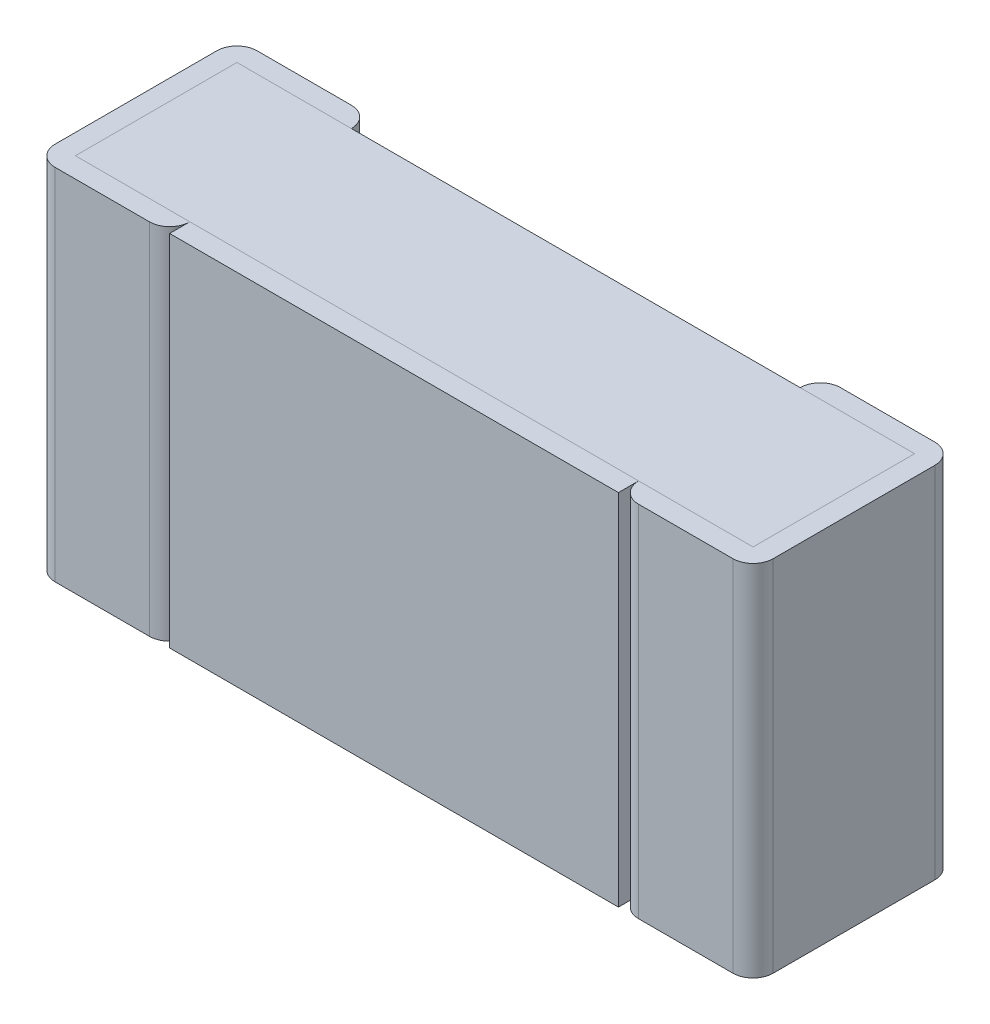
ISO-10303-21;
HEADER;
FILE_DESCRIPTION(('STEP AP214'),'2;1');
FILE_NAME('part.step','',(''),(''),'','','');
FILE_SCHEMA(('AUTOMOTIVE_DESIGN { 1 0 10303 214 1 1 1 1 }'));
ENDSEC;
DATA;
#1=APPLICATION_CONTEXT('core data for automotive mechanical design processes');
#2=APPLICATION_PROTOCOL_DEFINITION('international standard','automotive_design',2000,#1);
#3=PRODUCT_CONTEXT('',#1,'mechanical');
#4=PRODUCT('Part','Part','',(#3));
#5=PRODUCT_RELATED_PRODUCT_CATEGORY('part','',(#4));
#6=PRODUCT_DEFINITION_FORMATION('','',#4);
#7=PRODUCT_DEFINITION_CONTEXT('part definition',#1,'design');
#8=PRODUCT_DEFINITION('design','',#6,#7);
#9=PRODUCT_DEFINITION_SHAPE('','',#8);
#10=(LENGTH_UNIT() NAMED_UNIT(*) SI_UNIT(.MILLI.,.METRE.));
#11=(NAMED_UNIT(*) PLANE_ANGLE_UNIT() SI_UNIT($,.RADIAN.));
#12=(NAMED_UNIT(*) SI_UNIT($,.STERADIAN.) SOLID_ANGLE_UNIT());
#13=UNCERTAINTY_MEASURE_WITH_UNIT(LENGTH_MEASURE(1.E-05),#10,'distance_accuracy_value','');
#14=(GEOMETRIC_REPRESENTATION_CONTEXT(3) GLOBAL_UNCERTAINTY_ASSIGNED_CONTEXT((#13)) GLOBAL_UNIT_ASSIGNED_CONTEXT((#10,
#11,#12)) REPRESENTATION_CONTEXT('',''));
#15=CARTESIAN_POINT('',(0.,0.,0.));
#16=DIRECTION('',(0.,0.,1.));
#17=DIRECTION('',(1.,0.,0.));
#18=AXIS2_PLACEMENT_3D('',#15,#16,#17);
#19=CARTESIAN_POINT('',(132.066744279938,112.30804329235,112.661582908599));
#20=DIRECTION('',(0.,0.,1.));
#21=DIRECTION('',(1.,0.,0.));
#22=AXIS2_PLACEMENT_3D('',#19,#20,#21);
#23=PLANE('',#22);
#24=DIRECTION('',(0.,1.,0.));
#25=VECTOR('',#24,1.);
#26=CARTESIAN_POINT('',(132.066744279938,112.30804329235,112.661582908599));
#27=LINE('',#26,#25);
#28=CARTESIAN_POINT('',(132.066744279938,112.30804329235,112.661582908599));
#29=VERTEX_POINT('',#28);
#30=CARTESIAN_POINT('',(132.066744279938,113.10804329235,112.661582908599));
#31=VERTEX_POINT('',#30);
#32=EDGE_CURVE('E67',#29,#31,#27,.T.);
#33=ORIENTED_EDGE('',*,*,#32,.F.);
#34=DIRECTION('',(1.,0.,0.));
#35=VECTOR('',#34,1.);
#36=CARTESIAN_POINT('',(132.066744279938,112.30804329235,112.661582908599));
#37=LINE('',#36,#35);
#38=CARTESIAN_POINT('',(133.066744279938,112.30804329235,112.661582908599));
#39=VERTEX_POINT('',#38);
#40=EDGE_CURVE('E11',#29,#39,#37,.T.);
#41=ORIENTED_EDGE('',*,*,#40,.T.);
#42=DIRECTION('',(0.,1.,0.));
#43=VECTOR('',#42,1.);
#44=CARTESIAN_POINT('',(133.066744279938,112.30804329235,112.661582908599));
#45=LINE('',#44,#43);
#46=CARTESIAN_POINT('',(133.066744279938,113.10804329235,112.661582908599));
#47=VERTEX_POINT('',#46);
#48=EDGE_CURVE('E55',#39,#47,#45,.T.);
#49=ORIENTED_EDGE('',*,*,#48,.T.);
#50=DIRECTION('',(1.,0.,0.));
#51=VECTOR('',#50,1.);
#52=CARTESIAN_POINT('',(132.066744279938,113.10804329235,112.661582908599));
#53=LINE('',#52,#51);
#54=EDGE_CURVE('E338',#31,#47,#53,.T.);
#55=ORIENTED_EDGE('',*,*,#54,.F.);
#56=EDGE_LOOP('',(#33,#41,#49,#55));
#57=FACE_BOUND('',#56,.T.);
#58=ADVANCED_FACE('F44',(#57),#23,.T.);
#59=CARTESIAN_POINT('',(133.066744279938,112.30804329235,112.616582908599));
#60=DIRECTION('',(1.,0.,0.));
#61=DIRECTION('',(0.,1.,0.));
#62=AXIS2_PLACEMENT_3D('',#59,#60,#61);
#63=PLANE('',#62);
#64=DIRECTION('',(0.,0.,1.));
#65=VECTOR('',#64,1.);
#66=CARTESIAN_POINT('',(133.066744279938,112.30804329235,112.616582908599));
#67=LINE('',#66,#65);
#68=CARTESIAN_POINT('',(133.066744279938,112.30804329235,112.616582908599));
#69=VERTEX_POINT('',#68);
#70=EDGE_CURVE('E387',#69,#39,#67,.T.);
#71=ORIENTED_EDGE('',*,*,#70,.F.);
#72=DIRECTION('',(0.,1.,0.));
#73=VECTOR('',#72,1.);
#74=CARTESIAN_POINT('',(133.066744279938,112.30804329235,112.616582908599));
#75=LINE('',#74,#73);
#76=CARTESIAN_POINT('',(133.066744279938,113.10804329235,112.616582908599));
#77=VERTEX_POINT('',#76);
#78=EDGE_CURVE('E373',#69,#77,#75,.T.);
#79=ORIENTED_EDGE('',*,*,#78,.T.);
#80=DIRECTION('',(0.,0.,1.));
#81=VECTOR('',#80,1.);
#82=CARTESIAN_POINT('',(133.066744279938,113.10804329235,112.616582908599));
#83=LINE('',#82,#81);
#84=EDGE_CURVE('E377',#77,#47,#83,.T.);
#85=ORIENTED_EDGE('',*,*,#84,.T.);
#86=ORIENTED_EDGE('',*,*,#48,.F.);
#87=EDGE_LOOP('',(#71,#79,#85,#86));
#88=FACE_BOUND('',#87,.T.);
#89=ADVANCED_FACE('F568',(#88),#63,.T.);
#90=CARTESIAN_POINT('',(133.111744279938,112.30804329235,112.616582908599));
#91=DIRECTION('',(0.,1.,0.));
#92=DIRECTION('',(-1.,0.,0.));
#93=AXIS2_PLACEMENT_3D('',#90,#91,#92);
#94=CYLINDRICAL_SURFACE('',#93,0.0449999999999895);
#95=CARTESIAN_POINT('',(133.111744279938,112.30804329235,112.616582908599));
#96=DIRECTION('',(0.,1.,0.));
#97=DIRECTION('',(0.,0.,1.));
#98=AXIS2_PLACEMENT_3D('',#95,#96,#97);
#99=CIRCLE('',#98,0.0450000000000034);
#100=CARTESIAN_POINT('',(133.111744279938,112.30804329235,112.661582908599));
#101=VERTEX_POINT('',#100);
#102=EDGE_CURVE('E430',#69,#101,#99,.T.);
#103=ORIENTED_EDGE('',*,*,#102,.T.);
#104=DIRECTION('',(0.,1.,0.));
#105=VECTOR('',#104,1.);
#106=CARTESIAN_POINT('',(133.111744279938,112.30804329235,112.661582908599));
#107=LINE('',#106,#105);
#108=CARTESIAN_POINT('',(133.111744279938,113.10804329235,112.661582908599));
#109=VERTEX_POINT('',#108);
#110=EDGE_CURVE('E112',#101,#109,#107,.T.);
#111=ORIENTED_EDGE('',*,*,#110,.T.);
#112=CARTESIAN_POINT('',(133.111744279938,113.10804329235,112.616582908599));
#113=DIRECTION('',(0.,1.,0.));
#114=DIRECTION('',(0.,0.,1.));
#115=AXIS2_PLACEMENT_3D('',#112,#113,#114);
#116=CIRCLE('',#115,0.0450000000000034);
#117=EDGE_CURVE('E126',#77,#109,#116,.T.);
#118=ORIENTED_EDGE('',*,*,#117,.F.);
#119=ORIENTED_EDGE('',*,*,#78,.F.);
#120=EDGE_LOOP('',(#103,#111,#118,#119));
#121=FACE_BOUND('',#120,.T.);
#122=ADVANCED_FACE('F573',(#121),#94,.T.);
#123=CARTESIAN_POINT('',(133.066744279938,112.30804329235,112.661582908599));
#124=DIRECTION('',(0.,0.,1.));
#125=DIRECTION('',(1.,0.,0.));
#126=AXIS2_PLACEMENT_3D('',#123,#124,#125);
#127=PLANE('',#126);
#128=DIRECTION('',(1.,0.,0.));
#129=VECTOR('',#128,1.);
#130=CARTESIAN_POINT('',(133.066744279938,113.10804329235,112.661582908599));
#131=LINE('',#130,#129);
#132=CARTESIAN_POINT('',(133.321744279938,113.10804329235,112.661582908599));
#133=VERTEX_POINT('',#132);
#134=EDGE_CURVE('E302',#109,#133,#131,.T.);
#135=ORIENTED_EDGE('',*,*,#134,.F.);
#136=ORIENTED_EDGE('',*,*,#110,.F.);
#137=DIRECTION('',(1.,0.,0.));
#138=VECTOR('',#137,1.);
#139=CARTESIAN_POINT('',(133.066744279938,112.30804329235,112.661582908599));
#140=LINE('',#139,#138);
#141=CARTESIAN_POINT('',(133.321744279938,112.30804329235,112.661582908599));
#142=VERTEX_POINT('',#141);
#143=EDGE_CURVE('E431',#101,#142,#140,.T.);
#144=ORIENTED_EDGE('',*,*,#143,.T.);
#145=DIRECTION('',(0.,1.,0.));
#146=VECTOR('',#145,1.);
#147=CARTESIAN_POINT('',(133.321744279938,112.30804329235,112.661582908599));
#148=LINE('',#147,#146);
#149=EDGE_CURVE('E473',#142,#133,#148,.T.);
#150=ORIENTED_EDGE('',*,*,#149,.T.);
#151=EDGE_LOOP('',(#135,#136,#144,#150));
#152=FACE_BOUND('',#151,.T.);
#153=ADVANCED_FACE('F601',(#152),#127,.T.);
#154=CARTESIAN_POINT('',(133.321744279938,112.30804329235,112.616582908599));
#155=DIRECTION('',(0.,1.,0.));
#156=DIRECTION('',(1.,0.,0.));
#157=AXIS2_PLACEMENT_3D('',#154,#155,#156);
#158=CYLINDRICAL_SURFACE('',#157,0.0449999999999895);
#159=DIRECTION('',(0.,1.,0.));
#160=VECTOR('',#159,1.);
#161=CARTESIAN_POINT('',(133.366744279938,112.30804329235,112.616582908599));
#162=LINE('',#161,#160);
#163=CARTESIAN_POINT('',(133.366744279938,112.30804329235,112.616582908599));
#164=VERTEX_POINT('',#163);
#165=CARTESIAN_POINT('',(133.366744279938,113.10804329235,112.616582908599));
#166=VERTEX_POINT('',#165);
#167=EDGE_CURVE('E372',#164,#166,#162,.T.);
#168=ORIENTED_EDGE('',*,*,#167,.T.);
#169=CARTESIAN_POINT('',(133.321744279938,113.10804329235,112.616582908599));
#170=DIRECTION('',(0.,-1.,0.));
#171=DIRECTION('',(0.,0.,1.));
#172=AXIS2_PLACEMENT_3D('',#169,#170,#171);
#173=CIRCLE('',#172,0.0450000000000034);
#174=EDGE_CURVE('E368',#166,#133,#173,.T.);
#175=ORIENTED_EDGE('',*,*,#174,.T.);
#176=ORIENTED_EDGE('',*,*,#149,.F.);
#177=CARTESIAN_POINT('',(133.321744279938,112.30804329235,112.616582908599));
#178=DIRECTION('',(0.,-1.,0.));
#179=DIRECTION('',(0.,0.,1.));
#180=AXIS2_PLACEMENT_3D('',#177,#178,#179);
#181=CIRCLE('',#180,0.0450000000000034);
#182=EDGE_CURVE('E359',#164,#142,#181,.T.);
#183=ORIENTED_EDGE('',*,*,#182,.F.);
#184=EDGE_LOOP('',(#168,#175,#176,#183));
#185=FACE_BOUND('',#184,.T.);
#186=ADVANCED_FACE('F46',(#185),#158,.T.);
#187=CARTESIAN_POINT('',(133.366744279938,112.30804329235,112.211582908599));
#188=DIRECTION('',(1.,0.,0.));
#189=DIRECTION('',(0.,1.,0.));
#190=AXIS2_PLACEMENT_3D('',#187,#188,#189);
#191=PLANE('',#190);
#192=DIRECTION('',(0.,0.,1.));
#193=VECTOR('',#192,1.);
#194=CARTESIAN_POINT('',(133.366744279938,112.30804329235,112.211582908599));
#195=LINE('',#194,#193);
#196=CARTESIAN_POINT('',(133.366744279938,112.30804329235,112.256582908599));
#197=VERTEX_POINT('',#196);
#198=EDGE_CURVE('E354',#197,#164,#195,.T.);
#199=ORIENTED_EDGE('',*,*,#198,.F.);
#200=DIRECTION('',(0.,1.,0.));
#201=VECTOR('',#200,1.);
#202=CARTESIAN_POINT('',(133.366744279938,112.30804329235,112.256582908599));
#203=LINE('',#202,#201);
#204=CARTESIAN_POINT('',(133.366744279938,113.10804329235,112.256582908599));
#205=VERTEX_POINT('',#204);
#206=EDGE_CURVE('E310',#197,#205,#203,.T.);
#207=ORIENTED_EDGE('',*,*,#206,.T.);
#208=DIRECTION('',(0.,0.,1.));
#209=VECTOR('',#208,1.);
#210=CARTESIAN_POINT('',(133.366744279938,113.10804329235,112.211582908599));
#211=LINE('',#210,#209);
#212=EDGE_CURVE('E306',#205,#166,#211,.T.);
#213=ORIENTED_EDGE('',*,*,#212,.T.);
#214=ORIENTED_EDGE('',*,*,#167,.F.);
#215=EDGE_LOOP('',(#199,#207,#213,#214));
#216=FACE_BOUND('',#215,.T.);
#217=ADVANCED_FACE('F501',(#216),#191,.T.);
#218=CARTESIAN_POINT('',(133.321744279938,112.30804329235,112.256582908599));
#219=DIRECTION('',(0.,1.,0.));
#220=DIRECTION('',(1.,0.,0.));
#221=AXIS2_PLACEMENT_3D('',#218,#219,#220);
#222=CYLINDRICAL_SURFACE('',#221,0.0449999999999895);
#223=CARTESIAN_POINT('',(133.321744279938,112.30804329235,112.256582908599));
#224=DIRECTION('',(0.,1.,0.));
#225=DIRECTION('',(0.,0.,1.));
#226=AXIS2_PLACEMENT_3D('',#223,#224,#225);
#227=CIRCLE('',#226,0.0450000000000034);
#228=CARTESIAN_POINT('',(133.321744279938,112.30804329235,112.211582908599));
#229=VERTEX_POINT('',#228);
#230=EDGE_CURVE('E311',#197,#229,#227,.T.);
#231=ORIENTED_EDGE('',*,*,#230,.T.);
#232=DIRECTION('',(0.,1.,0.));
#233=VECTOR('',#232,1.);
#234=CARTESIAN_POINT('',(133.321744279938,112.30804329235,112.211582908599));
#235=LINE('',#234,#233);
#236=CARTESIAN_POINT('',(133.321744279938,113.10804329235,112.211582908599));
#237=VERTEX_POINT('',#236);
#238=EDGE_CURVE('E435',#229,#237,#235,.T.);
#239=ORIENTED_EDGE('',*,*,#238,.T.);
#240=CARTESIAN_POINT('',(133.321744279938,113.10804329235,112.256582908599));
#241=DIRECTION('',(0.,1.,0.));
#242=DIRECTION('',(0.,0.,1.));
#243=AXIS2_PLACEMENT_3D('',#240,#241,#242);
#244=CIRCLE('',#243,0.0450000000000034);
#245=EDGE_CURVE('E305',#205,#237,#244,.T.);
#246=ORIENTED_EDGE('',*,*,#245,.F.);
#247=ORIENTED_EDGE('',*,*,#206,.F.);
#248=EDGE_LOOP('',(#231,#239,#246,#247));
#249=FACE_BOUND('',#248,.T.);
#250=ADVANCED_FACE('F505',(#249),#222,.T.);
#251=CARTESIAN_POINT('',(133.066744279938,112.30804329235,112.211582908599));
#252=DIRECTION('',(0.,0.,1.));
#253=DIRECTION('',(1.,0.,0.));
#254=AXIS2_PLACEMENT_3D('',#251,#252,#253);
#255=PLANE('',#254);
#256=ORIENTED_EDGE('',*,*,#238,.F.);
#257=DIRECTION('',(1.,0.,0.));
#258=VECTOR('',#257,1.);
#259=CARTESIAN_POINT('',(133.066744279938,112.30804329235,112.211582908599));
#260=LINE('',#259,#258);
#261=CARTESIAN_POINT('',(133.111744279938,112.30804329235,112.211582908599));
#262=VERTEX_POINT('',#261);
#263=EDGE_CURVE('E326',#262,#229,#260,.T.);
#264=ORIENTED_EDGE('',*,*,#263,.F.);
#265=DIRECTION('',(0.,1.,0.));
#266=VECTOR('',#265,1.);
#267=CARTESIAN_POINT('',(133.111744279938,112.30804329235,112.211582908599));
#268=LINE('',#267,#266);
#269=CARTESIAN_POINT('',(133.111744279938,113.10804329235,112.211582908599));
#270=VERTEX_POINT('',#269);
#271=EDGE_CURVE('E316',#262,#270,#268,.T.);
#272=ORIENTED_EDGE('',*,*,#271,.T.);
#273=DIRECTION('',(1.,0.,0.));
#274=VECTOR('',#273,1.);
#275=CARTESIAN_POINT('',(133.066744279938,113.10804329235,112.211582908599));
#276=LINE('',#275,#274);
#277=EDGE_CURVE('E312',#270,#237,#276,.T.);
#278=ORIENTED_EDGE('',*,*,#277,.T.);
#279=EDGE_LOOP('',(#256,#264,#272,#278));
#280=FACE_BOUND('',#279,.T.);
#281=ADVANCED_FACE('F555',(#280),#255,.F.);
#282=CARTESIAN_POINT('',(133.111744279938,112.30804329235,112.256582908599));
#283=DIRECTION('',(0.,1.,0.));
#284=DIRECTION('',(-1.,0.,0.));
#285=AXIS2_PLACEMENT_3D('',#282,#283,#284);
#286=CYLINDRICAL_SURFACE('',#285,0.0449999999999895);
#287=DIRECTION('',(0.,1.,0.));
#288=VECTOR('',#287,1.);
#289=CARTESIAN_POINT('',(133.066744279938,112.30804329235,112.256582908599));
#290=LINE('',#289,#288);
#291=CARTESIAN_POINT('',(133.066744279938,112.30804329235,112.256582908599));
#292=VERTEX_POINT('',#291);
#293=CARTESIAN_POINT('',(133.066744279938,113.10804329235,112.256582908599));
#294=VERTEX_POINT('',#293);
#295=EDGE_CURVE('E317',#292,#294,#290,.T.);
#296=ORIENTED_EDGE('',*,*,#295,.T.);
#297=CARTESIAN_POINT('',(133.111744279938,113.10804329235,112.256582908599));
#298=DIRECTION('',(0.,-1.,0.));
#299=DIRECTION('',(0.,0.,1.));
#300=AXIS2_PLACEMENT_3D('',#297,#298,#299);
#301=CIRCLE('',#300,0.0450000000000034);
#302=EDGE_CURVE('E337',#294,#270,#301,.T.);
#303=ORIENTED_EDGE('',*,*,#302,.T.);
#304=ORIENTED_EDGE('',*,*,#271,.F.);
#305=CARTESIAN_POINT('',(133.111744279938,112.30804329235,112.256582908599));
#306=DIRECTION('',(0.,-1.,0.));
#307=DIRECTION('',(0.,0.,1.));
#308=AXIS2_PLACEMENT_3D('',#305,#306,#307);
#309=CIRCLE('',#308,0.0450000000000034);
#310=EDGE_CURVE('E321',#292,#262,#309,.T.);
#311=ORIENTED_EDGE('',*,*,#310,.F.);
#312=EDGE_LOOP('',(#296,#303,#304,#311));
#313=FACE_BOUND('',#312,.T.);
#314=ADVANCED_FACE('F554',(#313),#286,.T.);
#315=CARTESIAN_POINT('',(132.066744279938,113.10804329235,112.616582908599));
#316=DIRECTION('',(0.,1.,0.));
#317=DIRECTION('',(1.,0.,0.));
#318=AXIS2_PLACEMENT_3D('',#315,#316,#317);
#319=PLANE('',#318);
#320=DIRECTION('',(1.,0.,0.));
#321=VECTOR('',#320,1.);
#322=CARTESIAN_POINT('',(132.066744279938,113.10804329235,112.616582908599));
#323=LINE('',#322,#321);
#324=CARTESIAN_POINT('',(132.066744279938,113.10804329235,112.616582908599));
#325=VERTEX_POINT('',#324);
#326=EDGE_CURVE('E397',#325,#77,#323,.T.);
#327=ORIENTED_EDGE('',*,*,#326,.F.);
#328=DIRECTION('',(0.,0.,1.));
#329=VECTOR('',#328,1.);
#330=CARTESIAN_POINT('',(132.066744279938,113.10804329235,112.616582908599));
#331=LINE('',#330,#329);
#332=EDGE_CURVE('E334',#325,#31,#331,.T.);
#333=ORIENTED_EDGE('',*,*,#332,.T.);
#334=ORIENTED_EDGE('',*,*,#54,.T.);
#335=ORIENTED_EDGE('',*,*,#84,.F.);
#336=EDGE_LOOP('',(#327,#333,#334,#335));
#337=FACE_BOUND('',#336,.T.);
#338=ADVANCED_FACE('F562',(#337),#319,.T.);
#339=CARTESIAN_POINT('',(133.066744279938,113.10804329235,112.211582908599));
#340=DIRECTION('',(0.,1.,0.));
#341=DIRECTION('',(1.,0.,0.));
#342=AXIS2_PLACEMENT_3D('',#339,#340,#341);
#343=PLANE('',#342);
#344=ORIENTED_EDGE('',*,*,#277,.F.);
#345=ORIENTED_EDGE('',*,*,#302,.F.);
#346=DIRECTION('',(1.,0.,0.));
#347=VECTOR('',#346,1.);
#348=CARTESIAN_POINT('',(131.811744279938,113.10804329235,112.256582908599));
#349=LINE('',#348,#347);
#350=CARTESIAN_POINT('',(133.321744279938,113.10804329235,112.256582908599));
#351=VERTEX_POINT('',#350);
#352=EDGE_CURVE('E366',#294,#351,#349,.T.);
#353=ORIENTED_EDGE('',*,*,#352,.T.);
#354=DIRECTION('',(0.,0.,1.));
#355=VECTOR('',#354,1.);
#356=CARTESIAN_POINT('',(133.321744279938,113.10804329235,112.256582908599));
#357=LINE('',#356,#355);
#358=CARTESIAN_POINT('',(133.321744279938,113.10804329235,112.616582908599));
#359=VERTEX_POINT('',#358);
#360=EDGE_CURVE('E329',#351,#359,#357,.T.);
#361=ORIENTED_EDGE('',*,*,#360,.T.);
#362=DIRECTION('',(1.,0.,0.));
#363=VECTOR('',#362,1.);
#364=CARTESIAN_POINT('',(131.811744279938,113.10804329235,112.616582908599));
#365=LINE('',#364,#363);
#366=EDGE_CURVE('E353',#77,#359,#365,.T.);
#367=ORIENTED_EDGE('',*,*,#366,.F.);
#368=ORIENTED_EDGE('',*,*,#117,.T.);
#369=ORIENTED_EDGE('',*,*,#134,.T.);
#370=ORIENTED_EDGE('',*,*,#174,.F.);
#371=ORIENTED_EDGE('',*,*,#212,.F.);
#372=ORIENTED_EDGE('',*,*,#245,.T.);
#373=EDGE_LOOP('',(#344,#345,#353,#361,#367,#368,#369,#370,#371,#372));
#374=FACE_BOUND('',#373,.T.);
#375=ADVANCED_FACE('F506',(#374),#343,.T.);
#376=CARTESIAN_POINT('',(132.066744279938,112.30804329235,112.616582908599));
#377=DIRECTION('',(1.,0.,0.));
#378=DIRECTION('',(0.,1.,0.));
#379=AXIS2_PLACEMENT_3D('',#376,#377,#378);
#380=PLANE('',#379);
#381=ORIENTED_EDGE('',*,*,#32,.T.);
#382=ORIENTED_EDGE('',*,*,#332,.F.);
#383=DIRECTION('',(0.,1.,0.));
#384=VECTOR('',#383,1.);
#385=CARTESIAN_POINT('',(132.066744279938,112.30804329235,112.616582908599));
#386=LINE('',#385,#384);
#387=CARTESIAN_POINT('',(132.066744279938,112.30804329235,112.616582908599));
#388=VERTEX_POINT('',#387);
#389=EDGE_CURVE('E343',#388,#325,#386,.T.);
#390=ORIENTED_EDGE('',*,*,#389,.F.);
#391=DIRECTION('',(0.,0.,1.));
#392=VECTOR('',#391,1.);
#393=CARTESIAN_POINT('',(132.066744279938,112.30804329235,112.616582908599));
#394=LINE('',#393,#392);
#395=EDGE_CURVE('E383',#388,#29,#394,.T.);
#396=ORIENTED_EDGE('',*,*,#395,.T.);
#397=EDGE_LOOP('',(#381,#382,#390,#396));
#398=FACE_BOUND('',#397,.T.);
#399=ADVANCED_FACE('F578',(#398),#380,.F.);
#400=CARTESIAN_POINT('',(132.066744279938,112.30804329235,112.616582908599));
#401=DIRECTION('',(0.,1.,0.));
#402=DIRECTION('',(1.,0.,0.));
#403=AXIS2_PLACEMENT_3D('',#400,#401,#402);
#404=PLANE('',#403);
#405=ORIENTED_EDGE('',*,*,#70,.T.);
#406=ORIENTED_EDGE('',*,*,#40,.F.);
#407=ORIENTED_EDGE('',*,*,#395,.F.);
#408=DIRECTION('',(1.,0.,0.));
#409=VECTOR('',#408,1.);
#410=CARTESIAN_POINT('',(132.066744279938,112.30804329235,112.616582908599));
#411=LINE('',#410,#409);
#412=EDGE_CURVE('E358',#388,#69,#411,.T.);
#413=ORIENTED_EDGE('',*,*,#412,.T.);
#414=EDGE_LOOP('',(#405,#406,#407,#413));
#415=FACE_BOUND('',#414,.T.);
#416=ADVANCED_FACE('F582',(#415),#404,.F.);
#417=CARTESIAN_POINT('',(133.066744279938,112.30804329235,112.211582908599));
#418=DIRECTION('',(0.,1.,0.));
#419=DIRECTION('',(1.,0.,0.));
#420=AXIS2_PLACEMENT_3D('',#417,#418,#419);
#421=PLANE('',#420);
#422=ORIENTED_EDGE('',*,*,#230,.F.);
#423=ORIENTED_EDGE('',*,*,#198,.T.);
#424=ORIENTED_EDGE('',*,*,#182,.T.);
#425=ORIENTED_EDGE('',*,*,#143,.F.);
#426=ORIENTED_EDGE('',*,*,#102,.F.);
#427=DIRECTION('',(1.,0.,0.));
#428=VECTOR('',#427,1.);
#429=CARTESIAN_POINT('',(131.811744279938,112.30804329235,112.616582908599));
#430=LINE('',#429,#428);
#431=CARTESIAN_POINT('',(133.321744279938,112.30804329235,112.616582908599));
#432=VERTEX_POINT('',#431);
#433=EDGE_CURVE('E325',#69,#432,#430,.T.);
#434=ORIENTED_EDGE('',*,*,#433,.T.);
#435=DIRECTION('',(0.,0.,1.));
#436=VECTOR('',#435,1.);
#437=CARTESIAN_POINT('',(133.321744279938,112.30804329235,112.256582908599));
#438=LINE('',#437,#436);
#439=CARTESIAN_POINT('',(133.321744279938,112.30804329235,112.256582908599));
#440=VERTEX_POINT('',#439);
#441=EDGE_CURVE('E388',#440,#432,#438,.T.);
#442=ORIENTED_EDGE('',*,*,#441,.F.);
#443=DIRECTION('',(1.,0.,0.));
#444=VECTOR('',#443,1.);
#445=CARTESIAN_POINT('',(131.811744279938,112.30804329235,112.256582908599));
#446=LINE('',#445,#444);
#447=EDGE_CURVE('E333',#292,#440,#446,.T.);
#448=ORIENTED_EDGE('',*,*,#447,.F.);
#449=ORIENTED_EDGE('',*,*,#310,.T.);
#450=ORIENTED_EDGE('',*,*,#263,.T.);
#451=EDGE_LOOP('',(#422,#423,#424,#425,#426,#434,#442,#448,#449,#450));
#452=FACE_BOUND('',#451,.T.);
#453=ADVANCED_FACE('F509',(#452),#421,.F.);
#454=CARTESIAN_POINT('',(131.811744279938,112.30804329235,112.256582908599));
#455=DIRECTION('',(0.,0.,1.));
#456=DIRECTION('',(1.,0.,0.));
#457=AXIS2_PLACEMENT_3D('',#454,#455,#456);
#458=PLANE('',#457);
#459=DIRECTION('',(1.,0.,0.));
#460=VECTOR('',#459,1.);
#461=CARTESIAN_POINT('',(131.811744279938,113.10804329235,112.256582908599));
#462=LINE('',#461,#460);
#463=CARTESIAN_POINT('',(132.066744279938,113.10804329235,112.256582908599));
#464=VERTEX_POINT('',#463);
#465=EDGE_CURVE('E402',#464,#294,#462,.T.);
#466=ORIENTED_EDGE('',*,*,#465,.T.);
#467=ORIENTED_EDGE('',*,*,#295,.F.);
#468=DIRECTION('',(1.,0.,0.));
#469=VECTOR('',#468,1.);
#470=CARTESIAN_POINT('',(131.811744279938,112.30804329235,112.256582908599));
#471=LINE('',#470,#469);
#472=CARTESIAN_POINT('',(132.066744279938,112.30804329235,112.256582908599));
#473=VERTEX_POINT('',#472);
#474=EDGE_CURVE('E301',#473,#292,#471,.T.);
#475=ORIENTED_EDGE('',*,*,#474,.F.);
#476=DIRECTION('',(0.,1.,0.));
#477=VECTOR('',#476,1.);
#478=CARTESIAN_POINT('',(132.066744279938,112.30804329235,112.256582908599));
#479=LINE('',#478,#477);
#480=EDGE_CURVE('E398',#473,#464,#479,.T.);
#481=ORIENTED_EDGE('',*,*,#480,.T.);
#482=EDGE_LOOP('',(#466,#467,#475,#481));
#483=FACE_BOUND('',#482,.T.);
#484=ADVANCED_FACE('F551',(#483),#458,.F.);
#485=CARTESIAN_POINT('',(131.811744279938,113.10804329235,112.256582908599));
#486=DIRECTION('',(0.,1.,0.));
#487=DIRECTION('',(1.,0.,0.));
#488=AXIS2_PLACEMENT_3D('',#485,#486,#487);
#489=PLANE('',#488);
#490=DIRECTION('',(1.,0.,0.));
#491=VECTOR('',#490,1.);
#492=CARTESIAN_POINT('',(131.811744279938,113.10804329235,112.256582908599));
#493=LINE('',#492,#491);
#494=CARTESIAN_POINT('',(131.811744279938,113.10804329235,112.256582908599));
#495=VERTEX_POINT('',#494);
#496=EDGE_CURVE('E271',#495,#464,#493,.T.);
#497=ORIENTED_EDGE('',*,*,#496,.F.);
#498=DIRECTION('',(0.,0.,1.));
#499=VECTOR('',#498,1.);
#500=CARTESIAN_POINT('',(131.811744279938,113.10804329235,112.256582908599));
#501=LINE('',#500,#499);
#502=CARTESIAN_POINT('',(131.811744279938,113.10804329235,112.616582908599));
#503=VERTEX_POINT('',#502);
#504=EDGE_CURVE('E396',#495,#503,#501,.T.);
#505=ORIENTED_EDGE('',*,*,#504,.T.);
#506=DIRECTION('',(1.,0.,0.));
#507=VECTOR('',#506,1.);
#508=CARTESIAN_POINT('',(131.811744279938,113.10804329235,112.616582908599));
#509=LINE('',#508,#507);
#510=EDGE_CURVE('E392',#503,#325,#509,.T.);
#511=ORIENTED_EDGE('',*,*,#510,.T.);
#512=ORIENTED_EDGE('',*,*,#326,.T.);
#513=ORIENTED_EDGE('',*,*,#366,.T.);
#514=ORIENTED_EDGE('',*,*,#360,.F.);
#515=ORIENTED_EDGE('',*,*,#352,.F.);
#516=ORIENTED_EDGE('',*,*,#465,.F.);
#517=EDGE_LOOP('',(#497,#505,#511,#512,#513,#514,#515,#516));
#518=FACE_BOUND('',#517,.T.);
#519=ADVANCED_FACE('F588',(#518),#489,.T.);
#520=CARTESIAN_POINT('',(132.021744279938,112.30804329235,112.616582908599));
#521=DIRECTION('',(0.,1.,0.));
#522=DIRECTION('',(1.,0.,0.));
#523=AXIS2_PLACEMENT_3D('',#520,#521,#522);
#524=CYLINDRICAL_SURFACE('',#523,0.0449999999999895);
#525=ORIENTED_EDGE('',*,*,#389,.T.);
#526=CARTESIAN_POINT('',(132.021744279938,113.10804329235,112.616582908599));
#527=DIRECTION('',(0.,-1.,0.));
#528=DIRECTION('',(0.,0.,1.));
#529=AXIS2_PLACEMENT_3D('',#526,#527,#528);
#530=CIRCLE('',#529,0.0450000000000034);
#531=CARTESIAN_POINT('',(132.021744279938,113.10804329235,112.661582908599));
#532=VERTEX_POINT('',#531);
#533=EDGE_CURVE('E340',#325,#532,#530,.T.);
#534=ORIENTED_EDGE('',*,*,#533,.T.);
#535=DIRECTION('',(0.,1.,0.));
#536=VECTOR('',#535,1.);
#537=CARTESIAN_POINT('',(132.021744279938,112.30804329235,112.661582908599));
#538=LINE('',#537,#536);
#539=CARTESIAN_POINT('',(132.021744279938,112.30804329235,112.661582908599));
#540=VERTEX_POINT('',#539);
#541=EDGE_CURVE('E266',#540,#532,#538,.T.);
#542=ORIENTED_EDGE('',*,*,#541,.F.);
#543=CARTESIAN_POINT('',(132.021744279938,112.30804329235,112.616582908599));
#544=DIRECTION('',(0.,-1.,0.));
#545=DIRECTION('',(0.,0.,1.));
#546=AXIS2_PLACEMENT_3D('',#543,#544,#545);
#547=CIRCLE('',#546,0.0450000000000034);
#548=EDGE_CURVE('E447',#388,#540,#547,.T.);
#549=ORIENTED_EDGE('',*,*,#548,.F.);
#550=EDGE_LOOP('',(#525,#534,#542,#549));
#551=FACE_BOUND('',#550,.T.);
#552=ADVANCED_FACE('F586',(#551),#524,.T.);
#553=CARTESIAN_POINT('',(131.766744279938,112.30804329235,112.661582908599));
#554=DIRECTION('',(0.,0.,1.));
#555=DIRECTION('',(1.,0.,0.));
#556=AXIS2_PLACEMENT_3D('',#553,#554,#555);
#557=PLANE('',#556);
#558=DIRECTION('',(1.,0.,0.));
#559=VECTOR('',#558,1.);
#560=CARTESIAN_POINT('',(131.766744279938,113.10804329235,112.661582908599));
#561=LINE('',#560,#559);
#562=CARTESIAN_POINT('',(131.811744279938,113.10804329235,112.661582908599));
#563=VERTEX_POINT('',#562);
#564=EDGE_CURVE('E263',#563,#532,#561,.T.);
#565=ORIENTED_EDGE('',*,*,#564,.F.);
#566=DIRECTION('',(0.,1.,0.));
#567=VECTOR('',#566,1.);
#568=CARTESIAN_POINT('',(131.811744279938,112.30804329235,112.661582908599));
#569=LINE('',#568,#567);
#570=CARTESIAN_POINT('',(131.811744279938,112.30804329235,112.661582908599));
#571=VERTEX_POINT('',#570);
#572=EDGE_CURVE('E248',#571,#563,#569,.T.);
#573=ORIENTED_EDGE('',*,*,#572,.F.);
#574=DIRECTION('',(1.,0.,0.));
#575=VECTOR('',#574,1.);
#576=CARTESIAN_POINT('',(131.766744279938,112.30804329235,112.661582908599));
#577=LINE('',#576,#575);
#578=EDGE_CURVE('E300',#571,#540,#577,.T.);
#579=ORIENTED_EDGE('',*,*,#578,.T.);
#580=ORIENTED_EDGE('',*,*,#541,.T.);
#581=EDGE_LOOP('',(#565,#573,#579,#580));
#582=FACE_BOUND('',#581,.T.);
#583=ADVANCED_FACE('F264',(#582),#557,.T.);
#584=CARTESIAN_POINT('',(131.811744279938,112.30804329235,112.256582908599));
#585=DIRECTION('',(0.,1.,0.));
#586=DIRECTION('',(1.,0.,0.));
#587=AXIS2_PLACEMENT_3D('',#584,#585,#586);
#588=PLANE('',#587);
#589=ORIENTED_EDGE('',*,*,#474,.T.);
#590=ORIENTED_EDGE('',*,*,#447,.T.);
#591=ORIENTED_EDGE('',*,*,#441,.T.);
#592=ORIENTED_EDGE('',*,*,#433,.F.);
#593=ORIENTED_EDGE('',*,*,#412,.F.);
#594=DIRECTION('',(1.,0.,0.));
#595=VECTOR('',#594,1.);
#596=CARTESIAN_POINT('',(131.811744279938,112.30804329235,112.616582908599));
#597=LINE('',#596,#595);
#598=CARTESIAN_POINT('',(131.811744279938,112.30804329235,112.616582908599));
#599=VERTEX_POINT('',#598);
#600=EDGE_CURVE('E347',#599,#388,#597,.T.);
#601=ORIENTED_EDGE('',*,*,#600,.F.);
#602=DIRECTION('',(0.,0.,1.));
#603=VECTOR('',#602,1.);
#604=CARTESIAN_POINT('',(131.811744279938,112.30804329235,112.256582908599));
#605=LINE('',#604,#603);
#606=CARTESIAN_POINT('',(131.811744279938,112.30804329235,112.256582908599));
#607=VERTEX_POINT('',#606);
#608=EDGE_CURVE('E344',#607,#599,#605,.T.);
#609=ORIENTED_EDGE('',*,*,#608,.F.);
#610=DIRECTION('',(1.,0.,0.));
#611=VECTOR('',#610,1.);
#612=CARTESIAN_POINT('',(131.811744279938,112.30804329235,112.256582908599));
#613=LINE('',#612,#611);
#614=EDGE_CURVE('E287',#607,#473,#613,.T.);
#615=ORIENTED_EDGE('',*,*,#614,.T.);
#616=EDGE_LOOP('',(#589,#590,#591,#592,#593,#601,#609,#615));
#617=FACE_BOUND('',#616,.T.);
#618=ADVANCED_FACE('F548',(#617),#588,.F.);
#619=CARTESIAN_POINT('',(132.021744279938,112.30804329235,112.256582908599));
#620=DIRECTION('',(0.,1.,0.));
#621=DIRECTION('',(1.,0.,0.));
#622=AXIS2_PLACEMENT_3D('',#619,#620,#621);
#623=CYLINDRICAL_SURFACE('',#622,0.0449999999999895);
#624=CARTESIAN_POINT('',(132.021744279938,112.30804329235,112.256582908599));
#625=DIRECTION('',(0.,1.,0.));
#626=DIRECTION('',(0.,0.,1.));
#627=AXIS2_PLACEMENT_3D('',#624,#625,#626);
#628=CIRCLE('',#627,0.0450000000000034);
#629=CARTESIAN_POINT('',(132.021744279938,112.30804329235,112.211582908599));
#630=VERTEX_POINT('',#629);
#631=EDGE_CURVE('E292',#473,#630,#628,.T.);
#632=ORIENTED_EDGE('',*,*,#631,.T.);
#633=DIRECTION('',(0.,1.,0.));
#634=VECTOR('',#633,1.);
#635=CARTESIAN_POINT('',(132.021744279938,112.30804329235,112.211582908599));
#636=LINE('',#635,#634);
#637=CARTESIAN_POINT('',(132.021744279938,113.10804329235,112.211582908599));
#638=VERTEX_POINT('',#637);
#639=EDGE_CURVE('E289',#630,#638,#636,.T.);
#640=ORIENTED_EDGE('',*,*,#639,.T.);
#641=CARTESIAN_POINT('',(132.021744279938,113.10804329235,112.256582908599));
#642=DIRECTION('',(0.,1.,0.));
#643=DIRECTION('',(0.,0.,1.));
#644=AXIS2_PLACEMENT_3D('',#641,#642,#643);
#645=CIRCLE('',#644,0.0450000000000034);
#646=EDGE_CURVE('E318',#464,#638,#645,.T.);
#647=ORIENTED_EDGE('',*,*,#646,.F.);
#648=ORIENTED_EDGE('',*,*,#480,.F.);
#649=EDGE_LOOP('',(#632,#640,#647,#648));
#650=FACE_BOUND('',#649,.T.);
#651=ADVANCED_FACE('F542',(#650),#623,.T.);
#652=CARTESIAN_POINT('',(131.766744279938,112.30804329235,112.211582908599));
#653=DIRECTION('',(0.,0.,1.));
#654=DIRECTION('',(1.,0.,0.));
#655=AXIS2_PLACEMENT_3D('',#652,#653,#654);
#656=PLANE('',#655);
#657=ORIENTED_EDGE('',*,*,#639,.F.);
#658=DIRECTION('',(1.,0.,0.));
#659=VECTOR('',#658,1.);
#660=CARTESIAN_POINT('',(131.766744279938,112.30804329235,112.211582908599));
#661=LINE('',#660,#659);
#662=CARTESIAN_POINT('',(131.811744279938,112.30804329235,112.211582908599));
#663=VERTEX_POINT('',#662);
#664=EDGE_CURVE('E484',#663,#630,#661,.T.);
#665=ORIENTED_EDGE('',*,*,#664,.F.);
#666=DIRECTION('',(0.,1.,0.));
#667=VECTOR('',#666,1.);
#668=CARTESIAN_POINT('',(131.811744279938,112.30804329235,112.211582908599));
#669=LINE('',#668,#667);
#670=CARTESIAN_POINT('',(131.811744279938,113.10804329235,112.211582908599));
#671=VERTEX_POINT('',#670);
#672=EDGE_CURVE('E293',#663,#671,#669,.T.);
#673=ORIENTED_EDGE('',*,*,#672,.T.);
#674=DIRECTION('',(1.,0.,0.));
#675=VECTOR('',#674,1.);
#676=CARTESIAN_POINT('',(131.766744279938,113.10804329235,112.211582908599));
#677=LINE('',#676,#675);
#678=EDGE_CURVE('E283',#671,#638,#677,.T.);
#679=ORIENTED_EDGE('',*,*,#678,.T.);
#680=EDGE_LOOP('',(#657,#665,#673,#679));
#681=FACE_BOUND('',#680,.T.);
#682=ADVANCED_FACE('F539',(#681),#656,.F.);
#683=CARTESIAN_POINT('',(131.766744279938,113.10804329235,112.211582908599));
#684=DIRECTION('',(0.,1.,0.));
#685=DIRECTION('',(1.,0.,0.));
#686=AXIS2_PLACEMENT_3D('',#683,#684,#685);
#687=PLANE('',#686);
#688=ORIENTED_EDGE('',*,*,#678,.F.);
#689=CARTESIAN_POINT('',(131.811744279938,113.10804329235,112.256582908599));
#690=DIRECTION('',(0.,-1.,0.));
#691=DIRECTION('',(0.,0.,1.));
#692=AXIS2_PLACEMENT_3D('',#689,#690,#691);
#693=CIRCLE('',#692,0.0450000000000034);
#694=CARTESIAN_POINT('',(131.766744279938,113.10804329235,112.256582908599));
#695=VERTEX_POINT('',#694);
#696=EDGE_CURVE('E297',#695,#671,#693,.T.);
#697=ORIENTED_EDGE('',*,*,#696,.F.);
#698=DIRECTION('',(0.,0.,1.));
#699=VECTOR('',#698,1.);
#700=CARTESIAN_POINT('',(131.766744279938,113.10804329235,112.211582908599));
#701=LINE('',#700,#699);
#702=CARTESIAN_POINT('',(131.766744279938,113.10804329235,112.616582908599));
#703=VERTEX_POINT('',#702);
#704=EDGE_CURVE('E275',#695,#703,#701,.T.);
#705=ORIENTED_EDGE('',*,*,#704,.T.);
#706=CARTESIAN_POINT('',(131.811744279938,113.10804329235,112.616582908599));
#707=DIRECTION('',(0.,1.,0.));
#708=DIRECTION('',(0.,0.,1.));
#709=AXIS2_PLACEMENT_3D('',#706,#707,#708);
#710=CIRCLE('',#709,0.0450000000000034);
#711=EDGE_CURVE('E252',#703,#563,#710,.T.);
#712=ORIENTED_EDGE('',*,*,#711,.T.);
#713=ORIENTED_EDGE('',*,*,#564,.T.);
#714=ORIENTED_EDGE('',*,*,#533,.F.);
#715=ORIENTED_EDGE('',*,*,#510,.F.);
#716=ORIENTED_EDGE('',*,*,#504,.F.);
#717=ORIENTED_EDGE('',*,*,#496,.T.);
#718=ORIENTED_EDGE('',*,*,#646,.T.);
#719=EDGE_LOOP('',(#688,#697,#705,#712,#713,#714,#715,#716,#717,#718));
#720=FACE_BOUND('',#719,.T.);
#721=ADVANCED_FACE('F272',(#720),#687,.T.);
#722=CARTESIAN_POINT('',(131.811744279938,112.30804329235,112.616582908599));
#723=DIRECTION('',(0.,1.,0.));
#724=DIRECTION('',(-1.,0.,0.));
#725=AXIS2_PLACEMENT_3D('',#722,#723,#724);
#726=CYLINDRICAL_SURFACE('',#725,0.0449999999999895);
#727=CARTESIAN_POINT('',(131.811744279938,112.30804329235,112.616582908599));
#728=DIRECTION('',(0.,1.,0.));
#729=DIRECTION('',(0.,0.,1.));
#730=AXIS2_PLACEMENT_3D('',#727,#728,#729);
#731=CIRCLE('',#730,0.0450000000000034);
#732=CARTESIAN_POINT('',(131.766744279938,112.30804329235,112.616582908599));
#733=VERTEX_POINT('',#732);
#734=EDGE_CURVE('E255',#733,#571,#731,.T.);
#735=ORIENTED_EDGE('',*,*,#734,.T.);
#736=ORIENTED_EDGE('',*,*,#572,.T.);
#737=ORIENTED_EDGE('',*,*,#711,.F.);
#738=DIRECTION('',(0.,1.,0.));
#739=VECTOR('',#738,1.);
#740=CARTESIAN_POINT('',(131.766744279938,112.30804329235,112.616582908599));
#741=LINE('',#740,#739);
#742=EDGE_CURVE('E462',#733,#703,#741,.T.);
#743=ORIENTED_EDGE('',*,*,#742,.F.);
#744=EDGE_LOOP('',(#735,#736,#737,#743));
#745=FACE_BOUND('',#744,.T.);
#746=ADVANCED_FACE('F250',(#745),#726,.T.);
#747=CARTESIAN_POINT('',(131.811744279938,112.30804329235,112.256582908599));
#748=DIRECTION('',(0.,1.,0.));
#749=DIRECTION('',(-1.,0.,0.));
#750=AXIS2_PLACEMENT_3D('',#747,#748,#749);
#751=CYLINDRICAL_SURFACE('',#750,0.0449999999999895);
#752=DIRECTION('',(0.,1.,0.));
#753=VECTOR('',#752,1.);
#754=CARTESIAN_POINT('',(131.766744279938,112.30804329235,112.256582908599));
#755=LINE('',#754,#753);
#756=CARTESIAN_POINT('',(131.766744279938,112.30804329235,112.256582908599));
#757=VERTEX_POINT('',#756);
#758=EDGE_CURVE('E260',#757,#695,#755,.T.);
#759=ORIENTED_EDGE('',*,*,#758,.T.);
#760=ORIENTED_EDGE('',*,*,#696,.T.);
#761=ORIENTED_EDGE('',*,*,#672,.F.);
#762=CARTESIAN_POINT('',(131.811744279938,112.30804329235,112.256582908599));
#763=DIRECTION('',(0.,-1.,0.));
#764=DIRECTION('',(0.,0.,1.));
#765=AXIS2_PLACEMENT_3D('',#762,#763,#764);
#766=CIRCLE('',#765,0.0450000000000034);
#767=EDGE_CURVE('E48',#757,#663,#766,.T.);
#768=ORIENTED_EDGE('',*,*,#767,.F.);
#769=EDGE_LOOP('',(#759,#760,#761,#768));
#770=FACE_BOUND('',#769,.T.);
#771=ADVANCED_FACE('F533',(#770),#751,.T.);
#772=CARTESIAN_POINT('',(131.766744279938,112.30804329235,112.211582908599));
#773=DIRECTION('',(0.,1.,0.));
#774=DIRECTION('',(1.,0.,0.));
#775=AXIS2_PLACEMENT_3D('',#772,#773,#774);
#776=PLANE('',#775);
#777=ORIENTED_EDGE('',*,*,#631,.F.);
#778=ORIENTED_EDGE('',*,*,#614,.F.);
#779=ORIENTED_EDGE('',*,*,#608,.T.);
#780=ORIENTED_EDGE('',*,*,#600,.T.);
#781=ORIENTED_EDGE('',*,*,#548,.T.);
#782=ORIENTED_EDGE('',*,*,#578,.F.);
#783=ORIENTED_EDGE('',*,*,#734,.F.);
#784=DIRECTION('',(0.,0.,1.));
#785=VECTOR('',#784,1.);
#786=CARTESIAN_POINT('',(131.766744279938,112.30804329235,112.211582908599));
#787=LINE('',#786,#785);
#788=EDGE_CURVE('E458',#757,#733,#787,.T.);
#789=ORIENTED_EDGE('',*,*,#788,.F.);
#790=ORIENTED_EDGE('',*,*,#767,.T.);
#791=ORIENTED_EDGE('',*,*,#664,.T.);
#792=EDGE_LOOP('',(#777,#778,#779,#780,#781,#782,#783,#789,#790,#791));
#793=FACE_BOUND('',#792,.T.);
#794=ADVANCED_FACE('F529',(#793),#776,.F.);
#795=CARTESIAN_POINT('',(131.766744279938,112.30804329235,112.211582908599));
#796=DIRECTION('',(1.,0.,0.));
#797=DIRECTION('',(0.,1.,0.));
#798=AXIS2_PLACEMENT_3D('',#795,#796,#797);
#799=PLANE('',#798);
#800=ORIENTED_EDGE('',*,*,#742,.T.);
#801=ORIENTED_EDGE('',*,*,#704,.F.);
#802=ORIENTED_EDGE('',*,*,#758,.F.);
#803=ORIENTED_EDGE('',*,*,#788,.T.);
#804=EDGE_LOOP('',(#800,#801,#802,#803));
#805=FACE_BOUND('',#804,.T.);
#806=ADVANCED_FACE('F535',(#805),#799,.F.);
#807=CLOSED_SHELL('',(#58,#89,#122,#153,#186,#217,#250,#281,#314,#338,#375,#399,#416,#453,#484,
#519,#552,#583,#618,#651,#682,#721,#746,#771,#794,#806));
#808=MANIFOLD_SOLID_BREP('B2',#807);
#809=ADVANCED_BREP_SHAPE_REPRESENTATION('',(#18,#808),#14);
#810=SHAPE_DEFINITION_REPRESENTATION(#9,#809);
ENDSEC;
END-ISO-10303-21;
